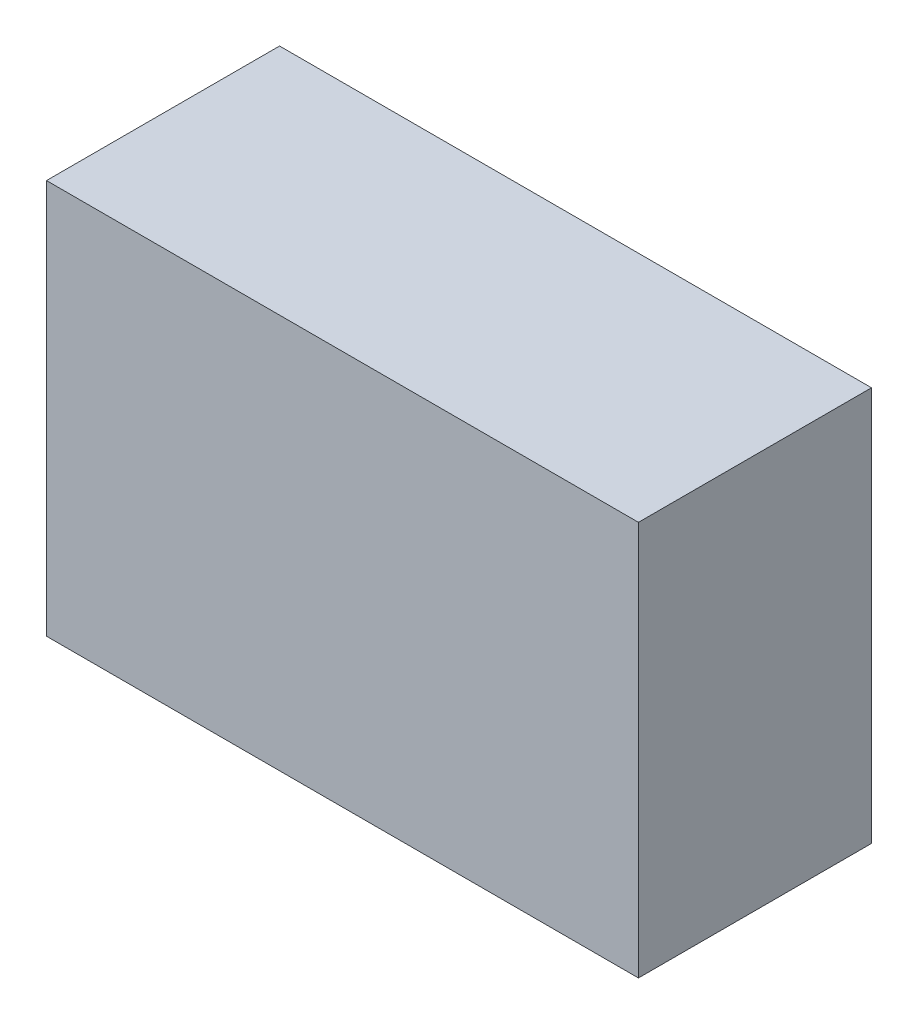
ISO-10303-21;
HEADER;
FILE_DESCRIPTION(('STEP AP214'),'2;1');
FILE_NAME('part.step','',(''),(''),'','','');
FILE_SCHEMA(('AUTOMOTIVE_DESIGN { 1 0 10303 214 1 1 1 1 }'));
ENDSEC;
DATA;
#1=APPLICATION_CONTEXT('core data for automotive mechanical design processes');
#2=APPLICATION_PROTOCOL_DEFINITION('international standard','automotive_design',2000,#1);
#3=PRODUCT_CONTEXT('',#1,'mechanical');
#4=PRODUCT('Part','Part','',(#3));
#5=PRODUCT_RELATED_PRODUCT_CATEGORY('part','',(#4));
#6=PRODUCT_DEFINITION_FORMATION('','',#4);
#7=PRODUCT_DEFINITION_CONTEXT('part definition',#1,'design');
#8=PRODUCT_DEFINITION('design','',#6,#7);
#9=PRODUCT_DEFINITION_SHAPE('','',#8);
#10=(LENGTH_UNIT() NAMED_UNIT(*) SI_UNIT(.MILLI.,.METRE.));
#11=(NAMED_UNIT(*) PLANE_ANGLE_UNIT() SI_UNIT($,.RADIAN.));
#12=(NAMED_UNIT(*) SI_UNIT($,.STERADIAN.) SOLID_ANGLE_UNIT());
#13=UNCERTAINTY_MEASURE_WITH_UNIT(LENGTH_MEASURE(1.E-05),#10,'distance_accuracy_value','');
#14=(GEOMETRIC_REPRESENTATION_CONTEXT(3) GLOBAL_UNCERTAINTY_ASSIGNED_CONTEXT((#13)) GLOBAL_UNIT_ASSIGNED_CONTEXT((#10,
#11,#12)) REPRESENTATION_CONTEXT('',''));
#15=CARTESIAN_POINT('',(0.,0.,0.));
#16=DIRECTION('',(0.,0.,1.));
#17=DIRECTION('',(1.,0.,0.));
#18=AXIS2_PLACEMENT_3D('',#15,#16,#17);
#19=CARTESIAN_POINT('',(6.35,3.81,5.));
#20=DIRECTION('',(0.,0.,-1.));
#21=DIRECTION('',(-1.,0.,0.));
#22=AXIS2_PLACEMENT_3D('',#19,#20,#21);
#23=PLANE('',#22);
#24=DIRECTION('',(0.,1.,0.));
#25=VECTOR('',#24,1.);
#26=CARTESIAN_POINT('',(-1.27,3.81,5.));
#27=LINE('',#26,#25);
#28=CARTESIAN_POINT('',(-1.27,3.81,5.));
#29=VERTEX_POINT('',#28);
#30=CARTESIAN_POINT('',(-1.27,-1.27,5.));
#31=VERTEX_POINT('',#30);
#32=EDGE_CURVE('E55',#29,#31,#27,.F.);
#33=ORIENTED_EDGE('',*,*,#32,.T.);
#34=DIRECTION('',(1.,0.,0.));
#35=VECTOR('',#34,1.);
#36=CARTESIAN_POINT('',(-1.27,-1.27,5.));
#37=LINE('',#36,#35);
#38=CARTESIAN_POINT('',(6.35,-1.27,5.));
#39=VERTEX_POINT('',#38);
#40=EDGE_CURVE('E57',#31,#39,#37,.T.);
#41=ORIENTED_EDGE('',*,*,#40,.T.);
#42=DIRECTION('',(0.,1.,0.));
#43=VECTOR('',#42,1.);
#44=CARTESIAN_POINT('',(6.35,-1.27,5.));
#45=LINE('',#44,#43);
#46=CARTESIAN_POINT('',(6.35,3.81,5.));
#47=VERTEX_POINT('',#46);
#48=EDGE_CURVE('E20',#39,#47,#45,.T.);
#49=ORIENTED_EDGE('',*,*,#48,.T.);
#50=DIRECTION('',(1.,0.,0.));
#51=VECTOR('',#50,1.);
#52=CARTESIAN_POINT('',(6.35,3.81,5.));
#53=LINE('',#52,#51);
#54=EDGE_CURVE('E80',#47,#29,#53,.F.);
#55=ORIENTED_EDGE('',*,*,#54,.T.);
#56=EDGE_LOOP('',(#33,#41,#49,#55));
#57=FACE_BOUND('',#56,.T.);
#58=ADVANCED_FACE('F17',(#57),#23,.F.);
#59=CARTESIAN_POINT('',(6.35,-1.27,2.));
#60=DIRECTION('',(-1.,0.,0.));
#61=DIRECTION('',(0.,0.,1.));
#62=AXIS2_PLACEMENT_3D('',#59,#60,#61);
#63=PLANE('',#62);
#64=DIRECTION('',(0.,0.,-1.));
#65=VECTOR('',#64,1.);
#66=CARTESIAN_POINT('',(6.35,3.81,2.));
#67=LINE('',#66,#65);
#68=CARTESIAN_POINT('',(6.35,3.81,2.));
#69=VERTEX_POINT('',#68);
#70=EDGE_CURVE('E68',#69,#47,#67,.F.);
#71=ORIENTED_EDGE('',*,*,#70,.T.);
#72=ORIENTED_EDGE('',*,*,#48,.F.);
#73=DIRECTION('',(0.,0.,1.));
#74=VECTOR('',#73,1.);
#75=CARTESIAN_POINT('',(6.35,-1.27,2.));
#76=LINE('',#75,#74);
#77=CARTESIAN_POINT('',(6.35,-1.27,2.));
#78=VERTEX_POINT('',#77);
#79=EDGE_CURVE('E63',#39,#78,#76,.F.);
#80=ORIENTED_EDGE('',*,*,#79,.T.);
#81=DIRECTION('',(0.,1.,0.));
#82=VECTOR('',#81,1.);
#83=CARTESIAN_POINT('',(6.35,3.81,2.));
#84=LINE('',#83,#82);
#85=EDGE_CURVE('E83',#69,#78,#84,.F.);
#86=ORIENTED_EDGE('',*,*,#85,.F.);
#87=EDGE_LOOP('',(#71,#72,#80,#86));
#88=FACE_BOUND('',#87,.T.);
#89=ADVANCED_FACE('F65',(#88),#63,.F.);
#90=CARTESIAN_POINT('',(-1.27,-1.27,2.));
#91=DIRECTION('',(0.,1.,0.));
#92=DIRECTION('',(0.,0.,1.));
#93=AXIS2_PLACEMENT_3D('',#90,#91,#92);
#94=PLANE('',#93);
#95=ORIENTED_EDGE('',*,*,#79,.F.);
#96=ORIENTED_EDGE('',*,*,#40,.F.);
#97=DIRECTION('',(0.,0.,-1.));
#98=VECTOR('',#97,1.);
#99=CARTESIAN_POINT('',(-1.27,-1.27,2.));
#100=LINE('',#99,#98);
#101=CARTESIAN_POINT('',(-1.27,-1.27,2.));
#102=VERTEX_POINT('',#101);
#103=EDGE_CURVE('E75',#31,#102,#100,.T.);
#104=ORIENTED_EDGE('',*,*,#103,.T.);
#105=DIRECTION('',(-1.,0.,0.));
#106=VECTOR('',#105,1.);
#107=CARTESIAN_POINT('',(6.35,-1.27,2.));
#108=LINE('',#107,#106);
#109=EDGE_CURVE('E72',#78,#102,#108,.T.);
#110=ORIENTED_EDGE('',*,*,#109,.F.);
#111=EDGE_LOOP('',(#95,#96,#104,#110));
#112=FACE_BOUND('',#111,.T.);
#113=ADVANCED_FACE('F70',(#112),#94,.F.);
#114=CARTESIAN_POINT('',(-1.27,3.81,2.));
#115=DIRECTION('',(1.,0.,0.));
#116=DIRECTION('',(0.,0.,-1.));
#117=AXIS2_PLACEMENT_3D('',#114,#115,#116);
#118=PLANE('',#117);
#119=ORIENTED_EDGE('',*,*,#103,.F.);
#120=ORIENTED_EDGE('',*,*,#32,.F.);
#121=DIRECTION('',(0.,0.,-1.));
#122=VECTOR('',#121,1.);
#123=CARTESIAN_POINT('',(-1.27,3.81,2.));
#124=LINE('',#123,#122);
#125=CARTESIAN_POINT('',(-1.27,3.81,2.));
#126=VERTEX_POINT('',#125);
#127=EDGE_CURVE('E35',#29,#126,#124,.T.);
#128=ORIENTED_EDGE('',*,*,#127,.T.);
#129=DIRECTION('',(0.,1.,0.));
#130=VECTOR('',#129,1.);
#131=CARTESIAN_POINT('',(-1.27,3.81,2.));
#132=LINE('',#131,#130);
#133=EDGE_CURVE('E26',#102,#126,#132,.T.);
#134=ORIENTED_EDGE('',*,*,#133,.F.);
#135=EDGE_LOOP('',(#119,#120,#128,#134));
#136=FACE_BOUND('',#135,.T.);
#137=ADVANCED_FACE('F89',(#136),#118,.F.);
#138=CARTESIAN_POINT('',(6.35,3.81,2.));
#139=DIRECTION('',(0.,-1.,0.));
#140=DIRECTION('',(0.,0.,-1.));
#141=AXIS2_PLACEMENT_3D('',#138,#139,#140);
#142=PLANE('',#141);
#143=ORIENTED_EDGE('',*,*,#127,.F.);
#144=ORIENTED_EDGE('',*,*,#54,.F.);
#145=ORIENTED_EDGE('',*,*,#70,.F.);
#146=DIRECTION('',(-1.,0.,0.));
#147=VECTOR('',#146,1.);
#148=CARTESIAN_POINT('',(6.35,3.81,2.));
#149=LINE('',#148,#147);
#150=EDGE_CURVE('E11',#126,#69,#149,.F.);
#151=ORIENTED_EDGE('',*,*,#150,.F.);
#152=EDGE_LOOP('',(#143,#144,#145,#151));
#153=FACE_BOUND('',#152,.T.);
#154=ADVANCED_FACE('F91',(#153),#142,.F.);
#155=CARTESIAN_POINT('',(6.35,3.81,2.));
#156=DIRECTION('',(0.,0.,-1.));
#157=DIRECTION('',(-1.,0.,0.));
#158=AXIS2_PLACEMENT_3D('',#155,#156,#157);
#159=PLANE('',#158);
#160=ORIENTED_EDGE('',*,*,#133,.T.);
#161=ORIENTED_EDGE('',*,*,#150,.T.);
#162=ORIENTED_EDGE('',*,*,#85,.T.);
#163=ORIENTED_EDGE('',*,*,#109,.T.);
#164=EDGE_LOOP('',(#160,#161,#162,#163));
#165=FACE_BOUND('',#164,.T.);
#166=ADVANCED_FACE('F88',(#165),#159,.T.);
#167=CLOSED_SHELL('',(#58,#89,#113,#137,#154,#166));
#168=MANIFOLD_SOLID_BREP('B1',#167);
#169=ADVANCED_BREP_SHAPE_REPRESENTATION('',(#18,#168),#14);
#170=SHAPE_DEFINITION_REPRESENTATION(#9,#169);
ENDSEC;
END-ISO-10303-21;
